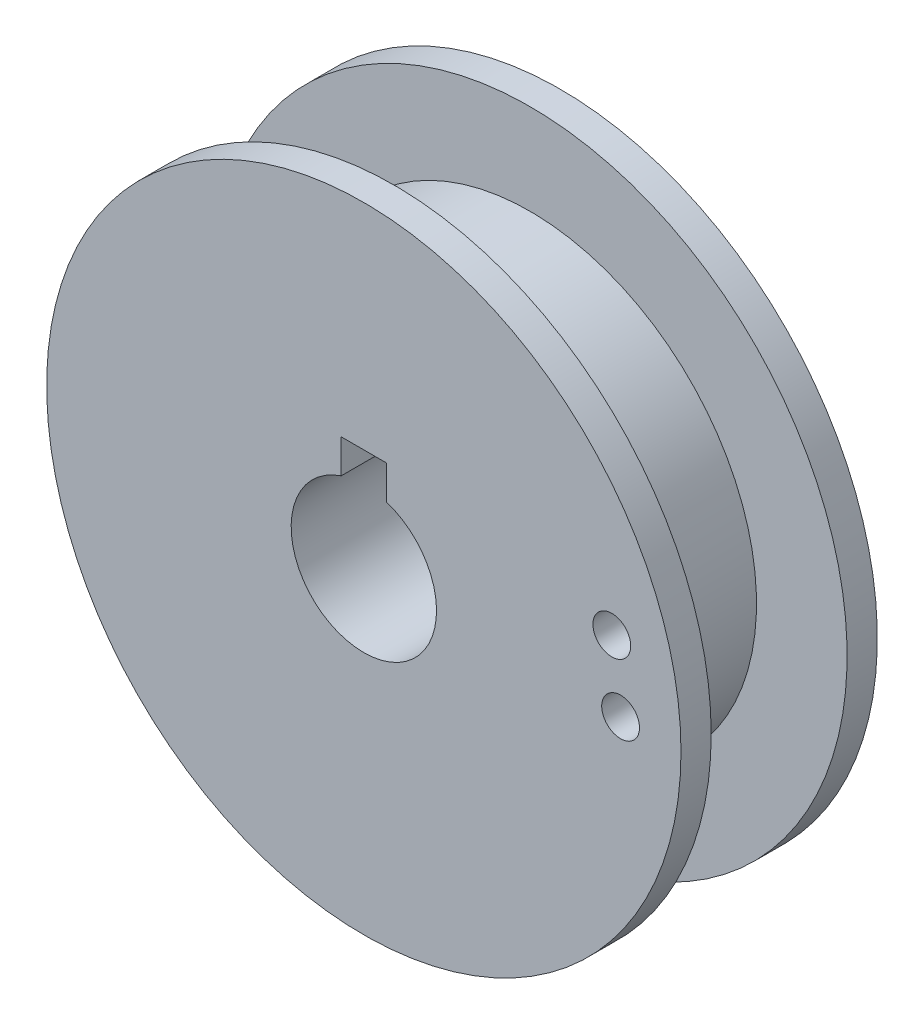
ISO-10303-21;
HEADER;
FILE_DESCRIPTION(('STEP AP214'),'2;1');
FILE_NAME('part.step','',(''),(''),'','','');
FILE_SCHEMA(('AUTOMOTIVE_DESIGN { 1 0 10303 214 1 1 1 1 }'));
ENDSEC;
DATA;
#1=APPLICATION_CONTEXT('core data for automotive mechanical design processes');
#2=APPLICATION_PROTOCOL_DEFINITION('international standard','automotive_design',2000,#1);
#3=PRODUCT_CONTEXT('',#1,'mechanical');
#4=PRODUCT('Part','Part','',(#3));
#5=PRODUCT_RELATED_PRODUCT_CATEGORY('part','',(#4));
#6=PRODUCT_DEFINITION_FORMATION('','',#4);
#7=PRODUCT_DEFINITION_CONTEXT('part definition',#1,'design');
#8=PRODUCT_DEFINITION('design','',#6,#7);
#9=PRODUCT_DEFINITION_SHAPE('','',#8);
#10=(LENGTH_UNIT() NAMED_UNIT(*) SI_UNIT(.MILLI.,.METRE.));
#11=(NAMED_UNIT(*) PLANE_ANGLE_UNIT() SI_UNIT($,.RADIAN.));
#12=(NAMED_UNIT(*) SI_UNIT($,.STERADIAN.) SOLID_ANGLE_UNIT());
#13=UNCERTAINTY_MEASURE_WITH_UNIT(LENGTH_MEASURE(1.E-05),#10,'distance_accuracy_value','');
#14=(GEOMETRIC_REPRESENTATION_CONTEXT(3) GLOBAL_UNCERTAINTY_ASSIGNED_CONTEXT((#13)) GLOBAL_UNIT_ASSIGNED_CONTEXT((#10,
#11,#12)) REPRESENTATION_CONTEXT('',''));
#15=CARTESIAN_POINT('',(0.,0.,0.));
#16=DIRECTION('',(0.,0.,1.));
#17=DIRECTION('',(1.,0.,0.));
#18=AXIS2_PLACEMENT_3D('',#15,#16,#17);
#19=CARTESIAN_POINT('',(0.,0.,2.));
#20=DIRECTION('',(0.,0.,-1.));
#21=DIRECTION('',(-1.,0.,0.));
#22=AXIS2_PLACEMENT_3D('',#19,#20,#21);
#23=CYLINDRICAL_SURFACE('',#22,21.);
#24=CARTESIAN_POINT('',(0.,0.,2.));
#25=DIRECTION('',(0.,0.,1.));
#26=DIRECTION('',(1.,0.,0.));
#27=AXIS2_PLACEMENT_3D('',#24,#25,#26);
#28=CIRCLE('',#27,21.);
#29=CARTESIAN_POINT('',(21.,0.,2.));
#30=VERTEX_POINT('',#29);
#31=EDGE_CURVE('E148',#30,#30,#28,.T.);
#32=ORIENTED_EDGE('',*,*,#31,.F.);
#33=EDGE_LOOP('',(#32));
#34=FACE_BOUND('',#33,.T.);
#35=CARTESIAN_POINT('',(0.,0.,0.));
#36=DIRECTION('',(0.,0.,1.));
#37=DIRECTION('',(1.,0.,0.));
#38=AXIS2_PLACEMENT_3D('',#35,#36,#37);
#39=CIRCLE('',#38,21.);
#40=CARTESIAN_POINT('',(21.,0.,0.));
#41=VERTEX_POINT('',#40);
#42=EDGE_CURVE('E144',#41,#41,#39,.T.);
#43=ORIENTED_EDGE('',*,*,#42,.T.);
#44=EDGE_LOOP('',(#43));
#45=FACE_BOUND('',#44,.T.);
#46=ADVANCED_FACE('F49',(#34,#45),#23,.T.);
#47=CARTESIAN_POINT('',(0.,0.,2.));
#48=DIRECTION('',(0.,0.,1.));
#49=DIRECTION('',(1.,0.,0.));
#50=AXIS2_PLACEMENT_3D('',#47,#48,#49);
#51=PLANE('',#50);
#52=CARTESIAN_POINT('',(17.,0.,2.));
#53=DIRECTION('',(0.,0.,1.));
#54=DIRECTION('',(1.,0.,0.));
#55=AXIS2_PLACEMENT_3D('',#52,#53,#54);
#56=CIRCLE('',#55,1.25);
#57=CARTESIAN_POINT('',(18.25,0.,2.));
#58=VERTEX_POINT('',#57);
#59=EDGE_CURVE('E209',#58,#58,#56,.T.);
#60=ORIENTED_EDGE('',*,*,#59,.F.);
#61=EDGE_LOOP('',(#60));
#62=FACE_BOUND('',#61,.T.);
#63=CARTESIAN_POINT('',(16.4207390469142,4.39992376674287,2.));
#64=DIRECTION('',(0.,0.,1.));
#65=DIRECTION('',(1.,0.,0.));
#66=AXIS2_PLACEMENT_3D('',#63,#64,#65);
#67=CIRCLE('',#66,1.25);
#68=CARTESIAN_POINT('',(17.6707390469142,4.39992376674287,2.));
#69=VERTEX_POINT('',#68);
#70=EDGE_CURVE('E119',#69,#69,#67,.T.);
#71=ORIENTED_EDGE('',*,*,#70,.F.);
#72=EDGE_LOOP('',(#71));
#73=FACE_BOUND('',#72,.T.);
#74=DIRECTION('',(0.,1.,0.));
#75=VECTOR('',#74,1.);
#76=CARTESIAN_POINT('',(-1.5,2.8125,2.));
#77=LINE('',#76,#75);
#78=CARTESIAN_POINT('',(-1.5,4.57276243096009,2.));
#79=VERTEX_POINT('',#78);
#80=CARTESIAN_POINT('',(-1.5,6.8125,2.));
#81=VERTEX_POINT('',#80);
#82=EDGE_CURVE('E91',#79,#81,#77,.T.);
#83=ORIENTED_EDGE('',*,*,#82,.T.);
#84=DIRECTION('',(1.,0.,0.));
#85=VECTOR('',#84,1.);
#86=CARTESIAN_POINT('',(1.5,6.8125,2.));
#87=LINE('',#86,#85);
#88=CARTESIAN_POINT('',(1.5,6.8125,2.));
#89=VERTEX_POINT('',#88);
#90=EDGE_CURVE('E102',#81,#89,#87,.T.);
#91=ORIENTED_EDGE('',*,*,#90,.T.);
#92=DIRECTION('',(0.,-1.,0.));
#93=VECTOR('',#92,1.);
#94=CARTESIAN_POINT('',(1.5,2.8125,2.));
#95=LINE('',#94,#93);
#96=CARTESIAN_POINT('',(1.5,4.57276243096009,2.));
#97=VERTEX_POINT('',#96);
#98=EDGE_CURVE('E99',#89,#97,#95,.T.);
#99=ORIENTED_EDGE('',*,*,#98,.T.);
#100=CARTESIAN_POINT('',(0.,0.,2.));
#101=DIRECTION('',(0.,0.,-1.));
#102=DIRECTION('',(-1.,0.,0.));
#103=AXIS2_PLACEMENT_3D('',#100,#101,#102);
#104=CIRCLE('',#103,4.8125);
#105=EDGE_CURVE('E111',#97,#79,#104,.T.);
#106=ORIENTED_EDGE('',*,*,#105,.T.);
#107=EDGE_LOOP('',(#83,#91,#99,#106));
#108=FACE_BOUND('',#107,.T.);
#109=ORIENTED_EDGE('',*,*,#31,.T.);
#110=EDGE_LOOP('',(#109));
#111=FACE_BOUND('',#110,.T.);
#112=ADVANCED_FACE('F108',(#62,#73,#108,#111),#51,.T.);
#113=CARTESIAN_POINT('',(0.,0.,0.));
#114=DIRECTION('',(0.,0.,1.));
#115=DIRECTION('',(1.,0.,0.));
#116=AXIS2_PLACEMENT_3D('',#113,#114,#115);
#117=PLANE('',#116);
#118=CARTESIAN_POINT('',(17.,0.,0.));
#119=DIRECTION('',(0.,0.,1.));
#120=DIRECTION('',(1.,0.,0.));
#121=AXIS2_PLACEMENT_3D('',#118,#119,#120);
#122=CIRCLE('',#121,1.25);
#123=CARTESIAN_POINT('',(18.25,0.,0.));
#124=VERTEX_POINT('',#123);
#125=EDGE_CURVE('E126',#124,#124,#122,.T.);
#126=ORIENTED_EDGE('',*,*,#125,.T.);
#127=EDGE_LOOP('',(#126));
#128=FACE_BOUND('',#127,.T.);
#129=CARTESIAN_POINT('',(16.4207390469142,4.39992376674287,0.));
#130=DIRECTION('',(0.,0.,1.));
#131=DIRECTION('',(1.,0.,0.));
#132=AXIS2_PLACEMENT_3D('',#129,#130,#131);
#133=CIRCLE('',#132,1.25);
#134=CARTESIAN_POINT('',(17.6707390469142,4.39992376674287,0.));
#135=VERTEX_POINT('',#134);
#136=EDGE_CURVE('E204',#135,#135,#133,.T.);
#137=ORIENTED_EDGE('',*,*,#136,.T.);
#138=EDGE_LOOP('',(#137));
#139=FACE_BOUND('',#138,.T.);
#140=CARTESIAN_POINT('',(0.,0.,0.));
#141=DIRECTION('',(0.,0.,-1.));
#142=DIRECTION('',(-1.,0.,0.));
#143=AXIS2_PLACEMENT_3D('',#140,#141,#142);
#144=CIRCLE('',#143,15.);
#145=CARTESIAN_POINT('',(-15.,0.,0.));
#146=VERTEX_POINT('',#145);
#147=EDGE_CURVE('E145',#146,#146,#144,.T.);
#148=ORIENTED_EDGE('',*,*,#147,.F.);
#149=EDGE_LOOP('',(#148));
#150=FACE_BOUND('',#149,.T.);
#151=ORIENTED_EDGE('',*,*,#42,.F.);
#152=EDGE_LOOP('',(#151));
#153=FACE_BOUND('',#152,.T.);
#154=ADVANCED_FACE('F184',(#128,#139,#150,#153),#117,.F.);
#155=CARTESIAN_POINT('',(0.,0.,-9.));
#156=DIRECTION('',(0.,0.,1.));
#157=DIRECTION('',(1.,0.,0.));
#158=AXIS2_PLACEMENT_3D('',#155,#156,#157);
#159=CYLINDRICAL_SURFACE('',#158,15.);
#160=CARTESIAN_POINT('',(0.,0.,-9.));
#161=DIRECTION('',(0.,0.,-1.));
#162=DIRECTION('',(-1.,0.,0.));
#163=AXIS2_PLACEMENT_3D('',#160,#161,#162);
#164=CIRCLE('',#163,15.);
#165=CARTESIAN_POINT('',(-15.,0.,-9.));
#166=VERTEX_POINT('',#165);
#167=EDGE_CURVE('E139',#166,#166,#164,.T.);
#168=ORIENTED_EDGE('',*,*,#167,.F.);
#169=EDGE_LOOP('',(#168));
#170=FACE_BOUND('',#169,.T.);
#171=ORIENTED_EDGE('',*,*,#147,.T.);
#172=EDGE_LOOP('',(#171));
#173=FACE_BOUND('',#172,.T.);
#174=ADVANCED_FACE('F168',(#170,#173),#159,.T.);
#175=CARTESIAN_POINT('',(0.,0.,-11.));
#176=DIRECTION('',(0.,0.,1.));
#177=DIRECTION('',(1.,0.,0.));
#178=AXIS2_PLACEMENT_3D('',#175,#176,#177);
#179=CYLINDRICAL_SURFACE('',#178,21.);
#180=CARTESIAN_POINT('',(0.,0.,-11.));
#181=DIRECTION('',(0.,0.,-1.));
#182=DIRECTION('',(-1.,0.,0.));
#183=AXIS2_PLACEMENT_3D('',#180,#181,#182);
#184=CIRCLE('',#183,21.);
#185=CARTESIAN_POINT('',(-21.,0.,-11.));
#186=VERTEX_POINT('',#185);
#187=EDGE_CURVE('E136',#186,#186,#184,.T.);
#188=ORIENTED_EDGE('',*,*,#187,.F.);
#189=EDGE_LOOP('',(#188));
#190=FACE_BOUND('',#189,.T.);
#191=CARTESIAN_POINT('',(0.,0.,-9.));
#192=DIRECTION('',(0.,0.,-1.));
#193=DIRECTION('',(-1.,0.,0.));
#194=AXIS2_PLACEMENT_3D('',#191,#192,#193);
#195=CIRCLE('',#194,21.);
#196=CARTESIAN_POINT('',(-21.,0.,-9.));
#197=VERTEX_POINT('',#196);
#198=EDGE_CURVE('E133',#197,#197,#195,.T.);
#199=ORIENTED_EDGE('',*,*,#198,.T.);
#200=EDGE_LOOP('',(#199));
#201=FACE_BOUND('',#200,.T.);
#202=ADVANCED_FACE('F162',(#190,#201),#179,.T.);
#203=CARTESIAN_POINT('',(0.,0.,-11.));
#204=DIRECTION('',(0.,0.,-1.));
#205=DIRECTION('',(-1.,0.,0.));
#206=AXIS2_PLACEMENT_3D('',#203,#204,#205);
#207=PLANE('',#206);
#208=DIRECTION('',(0.,1.,0.));
#209=VECTOR('',#208,1.);
#210=CARTESIAN_POINT('',(-1.5,2.8125,-11.));
#211=LINE('',#210,#209);
#212=CARTESIAN_POINT('',(-1.5,4.57276243096009,-11.));
#213=VERTEX_POINT('',#212);
#214=CARTESIAN_POINT('',(-1.5,6.8125,-11.));
#215=VERTEX_POINT('',#214);
#216=EDGE_CURVE('E93',#213,#215,#211,.T.);
#217=ORIENTED_EDGE('',*,*,#216,.F.);
#218=CARTESIAN_POINT('',(0.,0.,-11.));
#219=DIRECTION('',(0.,0.,-1.));
#220=DIRECTION('',(-1.,0.,0.));
#221=AXIS2_PLACEMENT_3D('',#218,#219,#220);
#222=CIRCLE('',#221,4.8125);
#223=CARTESIAN_POINT('',(1.5,4.57276243096009,-11.));
#224=VERTEX_POINT('',#223);
#225=EDGE_CURVE('E130',#224,#213,#222,.T.);
#226=ORIENTED_EDGE('',*,*,#225,.F.);
#227=DIRECTION('',(0.,-1.,0.));
#228=VECTOR('',#227,1.);
#229=CARTESIAN_POINT('',(1.5,2.8125,-11.));
#230=LINE('',#229,#228);
#231=CARTESIAN_POINT('',(1.5,6.8125,-11.));
#232=VERTEX_POINT('',#231);
#233=EDGE_CURVE('E64',#232,#224,#230,.T.);
#234=ORIENTED_EDGE('',*,*,#233,.F.);
#235=DIRECTION('',(1.,0.,0.));
#236=VECTOR('',#235,1.);
#237=CARTESIAN_POINT('',(1.5,6.8125,-11.));
#238=LINE('',#237,#236);
#239=EDGE_CURVE('E116',#215,#232,#238,.T.);
#240=ORIENTED_EDGE('',*,*,#239,.F.);
#241=EDGE_LOOP('',(#217,#226,#234,#240));
#242=FACE_BOUND('',#241,.T.);
#243=ORIENTED_EDGE('',*,*,#187,.T.);
#244=EDGE_LOOP('',(#243));
#245=FACE_BOUND('',#244,.T.);
#246=ADVANCED_FACE('F158',(#242,#245),#207,.T.);
#247=CARTESIAN_POINT('',(0.,0.,-9.));
#248=DIRECTION('',(0.,0.,-1.));
#249=DIRECTION('',(-1.,0.,0.));
#250=AXIS2_PLACEMENT_3D('',#247,#248,#249);
#251=PLANE('',#250);
#252=ORIENTED_EDGE('',*,*,#167,.T.);
#253=EDGE_LOOP('',(#252));
#254=FACE_BOUND('',#253,.T.);
#255=ORIENTED_EDGE('',*,*,#198,.F.);
#256=EDGE_LOOP('',(#255));
#257=FACE_BOUND('',#256,.T.);
#258=ADVANCED_FACE('F161',(#254,#257),#251,.F.);
#259=CARTESIAN_POINT('',(0.,0.,2.));
#260=DIRECTION('',(0.,0.,-1.));
#261=DIRECTION('',(-1.,0.,0.));
#262=AXIS2_PLACEMENT_3D('',#259,#260,#261);
#263=CYLINDRICAL_SURFACE('',#262,4.8125);
#264=ORIENTED_EDGE('',*,*,#225,.T.);
#265=DIRECTION('',(0.,0.,-1.));
#266=VECTOR('',#265,1.);
#267=CARTESIAN_POINT('',(-1.5,4.57276243096009,2.));
#268=LINE('',#267,#266);
#269=EDGE_CURVE('E13',#213,#79,#268,.F.);
#270=ORIENTED_EDGE('',*,*,#269,.T.);
#271=ORIENTED_EDGE('',*,*,#105,.F.);
#272=DIRECTION('',(0.,0.,-1.));
#273=VECTOR('',#272,1.);
#274=CARTESIAN_POINT('',(1.5,4.57276243096009,2.));
#275=LINE('',#274,#273);
#276=EDGE_CURVE('E57',#97,#224,#275,.T.);
#277=ORIENTED_EDGE('',*,*,#276,.T.);
#278=EDGE_LOOP('',(#264,#270,#271,#277));
#279=FACE_BOUND('',#278,.T.);
#280=ADVANCED_FACE('F156',(#279),#263,.F.);
#281=CARTESIAN_POINT('',(-1.5,2.8125,2.));
#282=DIRECTION('',(-1.,0.,0.));
#283=DIRECTION('',(0.,0.,1.));
#284=AXIS2_PLACEMENT_3D('',#281,#282,#283);
#285=PLANE('',#284);
#286=ORIENTED_EDGE('',*,*,#216,.T.);
#287=DIRECTION('',(0.,0.,-1.));
#288=VECTOR('',#287,1.);
#289=CARTESIAN_POINT('',(-1.5,6.8125,2.));
#290=LINE('',#289,#288);
#291=EDGE_CURVE('E87',#81,#215,#290,.T.);
#292=ORIENTED_EDGE('',*,*,#291,.F.);
#293=ORIENTED_EDGE('',*,*,#82,.F.);
#294=ORIENTED_EDGE('',*,*,#269,.F.);
#295=EDGE_LOOP('',(#286,#292,#293,#294));
#296=FACE_BOUND('',#295,.T.);
#297=ADVANCED_FACE('F89',(#296),#285,.F.);
#298=CARTESIAN_POINT('',(1.5,2.8125,2.));
#299=DIRECTION('',(1.,0.,0.));
#300=DIRECTION('',(0.,0.,-1.));
#301=AXIS2_PLACEMENT_3D('',#298,#299,#300);
#302=PLANE('',#301);
#303=ORIENTED_EDGE('',*,*,#98,.F.);
#304=DIRECTION('',(0.,0.,-1.));
#305=VECTOR('',#304,1.);
#306=CARTESIAN_POINT('',(1.5,6.8125,2.));
#307=LINE('',#306,#305);
#308=EDGE_CURVE('E98',#89,#232,#307,.T.);
#309=ORIENTED_EDGE('',*,*,#308,.T.);
#310=ORIENTED_EDGE('',*,*,#233,.T.);
#311=ORIENTED_EDGE('',*,*,#276,.F.);
#312=EDGE_LOOP('',(#303,#309,#310,#311));
#313=FACE_BOUND('',#312,.T.);
#314=ADVANCED_FACE('F234',(#313),#302,.F.);
#315=CARTESIAN_POINT('',(1.5,6.8125,2.));
#316=DIRECTION('',(0.,1.,0.));
#317=DIRECTION('',(0.,0.,1.));
#318=AXIS2_PLACEMENT_3D('',#315,#316,#317);
#319=PLANE('',#318);
#320=ORIENTED_EDGE('',*,*,#239,.T.);
#321=ORIENTED_EDGE('',*,*,#308,.F.);
#322=ORIENTED_EDGE('',*,*,#90,.F.);
#323=ORIENTED_EDGE('',*,*,#291,.T.);
#324=EDGE_LOOP('',(#320,#321,#322,#323));
#325=FACE_BOUND('',#324,.T.);
#326=ADVANCED_FACE('F103',(#325),#319,.F.);
#327=CARTESIAN_POINT('',(16.4207390469142,4.39992376674287,0.));
#328=DIRECTION('',(0.,0.,1.));
#329=DIRECTION('',(1.,0.,0.));
#330=AXIS2_PLACEMENT_3D('',#327,#328,#329);
#331=CYLINDRICAL_SURFACE('',#330,1.25);
#332=ORIENTED_EDGE('',*,*,#136,.F.);
#333=EDGE_LOOP('',(#332));
#334=FACE_BOUND('',#333,.T.);
#335=ORIENTED_EDGE('',*,*,#70,.T.);
#336=EDGE_LOOP('',(#335));
#337=FACE_BOUND('',#336,.T.);
#338=ADVANCED_FACE('F223',(#334,#337),#331,.F.);
#339=CARTESIAN_POINT('',(17.,0.,0.));
#340=DIRECTION('',(0.,0.,1.));
#341=DIRECTION('',(1.,0.,0.));
#342=AXIS2_PLACEMENT_3D('',#339,#340,#341);
#343=CYLINDRICAL_SURFACE('',#342,1.25);
#344=ORIENTED_EDGE('',*,*,#125,.F.);
#345=EDGE_LOOP('',(#344));
#346=FACE_BOUND('',#345,.T.);
#347=ORIENTED_EDGE('',*,*,#59,.T.);
#348=EDGE_LOOP('',(#347));
#349=FACE_BOUND('',#348,.T.);
#350=ADVANCED_FACE('F226',(#346,#349),#343,.F.);
#351=CLOSED_SHELL('',(#46,#112,#154,#174,#202,#246,#258,#280,#297,#314,#326,#338,#350));
#352=MANIFOLD_SOLID_BREP('B2',#351);
#353=ADVANCED_BREP_SHAPE_REPRESENTATION('',(#18,#352),#14);
#354=SHAPE_DEFINITION_REPRESENTATION(#9,#353);
ENDSEC;
END-ISO-10303-21;
